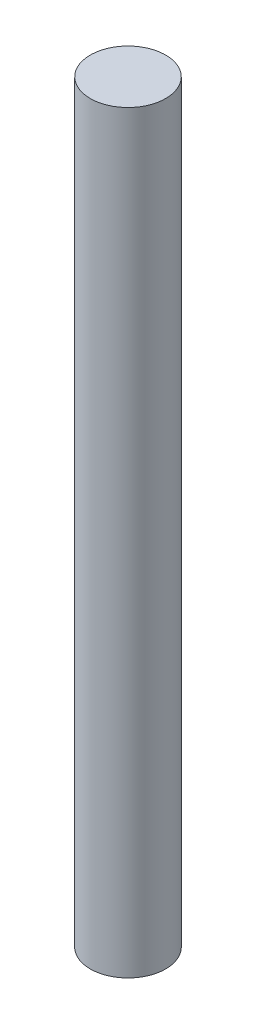
ISO-10303-21;
HEADER;
FILE_DESCRIPTION(('STEP AP214'),'2;1');
FILE_NAME('part.step','',(''),(''),'','','');
FILE_SCHEMA(('AUTOMOTIVE_DESIGN { 1 0 10303 214 1 1 1 1 }'));
ENDSEC;
DATA;
#1=APPLICATION_CONTEXT('core data for automotive mechanical design processes');
#2=APPLICATION_PROTOCOL_DEFINITION('international standard','automotive_design',2000,#1);
#3=PRODUCT_CONTEXT('',#1,'mechanical');
#4=PRODUCT('Part','Part','',(#3));
#5=PRODUCT_RELATED_PRODUCT_CATEGORY('part','',(#4));
#6=PRODUCT_DEFINITION_FORMATION('','',#4);
#7=PRODUCT_DEFINITION_CONTEXT('part definition',#1,'design');
#8=PRODUCT_DEFINITION('design','',#6,#7);
#9=PRODUCT_DEFINITION_SHAPE('','',#8);
#10=(LENGTH_UNIT() NAMED_UNIT(*) SI_UNIT(.MILLI.,.METRE.));
#11=(NAMED_UNIT(*) PLANE_ANGLE_UNIT() SI_UNIT($,.RADIAN.));
#12=(NAMED_UNIT(*) SI_UNIT($,.STERADIAN.) SOLID_ANGLE_UNIT());
#13=UNCERTAINTY_MEASURE_WITH_UNIT(LENGTH_MEASURE(1.E-05),#10,'distance_accuracy_value','');
#14=(GEOMETRIC_REPRESENTATION_CONTEXT(3) GLOBAL_UNCERTAINTY_ASSIGNED_CONTEXT((#13)) GLOBAL_UNIT_ASSIGNED_CONTEXT((#10,
#11,#12)) REPRESENTATION_CONTEXT('',''));
#15=CARTESIAN_POINT('',(0.,0.,0.));
#16=DIRECTION('',(0.,0.,1.));
#17=DIRECTION('',(1.,0.,0.));
#18=AXIS2_PLACEMENT_3D('',#15,#16,#17);
#19=CARTESIAN_POINT('',(0.,15.,0.));
#20=DIRECTION('',(0.,-1.,0.));
#21=DIRECTION('',(0.,0.,-1.));
#22=AXIS2_PLACEMENT_3D('',#19,#20,#21);
#23=CYLINDRICAL_SURFACE('',#22,1.5);
#24=CARTESIAN_POINT('',(0.,15.,0.));
#25=DIRECTION('',(0.,1.,0.));
#26=DIRECTION('',(0.,0.,1.));
#27=AXIS2_PLACEMENT_3D('',#24,#25,#26);
#28=CIRCLE('',#27,1.5);
#29=CARTESIAN_POINT('',(0.,15.,1.5));
#30=VERTEX_POINT('',#29);
#31=EDGE_CURVE('E10',#30,#30,#28,.T.);
#32=ORIENTED_EDGE('',*,*,#31,.F.);
#33=EDGE_LOOP('',(#32));
#34=FACE_BOUND('',#33,.T.);
#35=CARTESIAN_POINT('',(0.,-15.,0.));
#36=DIRECTION('',(0.,1.,0.));
#37=DIRECTION('',(0.,0.,1.));
#38=AXIS2_PLACEMENT_3D('',#35,#36,#37);
#39=CIRCLE('',#38,1.5);
#40=CARTESIAN_POINT('',(0.,-15.,1.5));
#41=VERTEX_POINT('',#40);
#42=EDGE_CURVE('E34',#41,#41,#39,.T.);
#43=ORIENTED_EDGE('',*,*,#42,.T.);
#44=EDGE_LOOP('',(#43));
#45=FACE_BOUND('',#44,.T.);
#46=ADVANCED_FACE('F31',(#34,#45),#23,.T.);
#47=CARTESIAN_POINT('',(0.,15.,0.));
#48=DIRECTION('',(0.,1.,0.));
#49=DIRECTION('',(0.,0.,1.));
#50=AXIS2_PLACEMENT_3D('',#47,#48,#49);
#51=PLANE('',#50);
#52=ORIENTED_EDGE('',*,*,#31,.T.);
#53=EDGE_LOOP('',(#52));
#54=FACE_BOUND('',#53,.T.);
#55=ADVANCED_FACE('F46',(#54),#51,.T.);
#56=CARTESIAN_POINT('',(0.,-15.,0.));
#57=DIRECTION('',(0.,1.,0.));
#58=DIRECTION('',(0.,0.,1.));
#59=AXIS2_PLACEMENT_3D('',#56,#57,#58);
#60=PLANE('',#59);
#61=ORIENTED_EDGE('',*,*,#42,.F.);
#62=EDGE_LOOP('',(#61));
#63=FACE_BOUND('',#62,.T.);
#64=ADVANCED_FACE('F44',(#63),#60,.F.);
#65=CLOSED_SHELL('',(#46,#55,#64));
#66=MANIFOLD_SOLID_BREP('B2',#65);
#67=ADVANCED_BREP_SHAPE_REPRESENTATION('',(#18,#66),#14);
#68=SHAPE_DEFINITION_REPRESENTATION(#9,#67);
ENDSEC;
END-ISO-10303-21;
